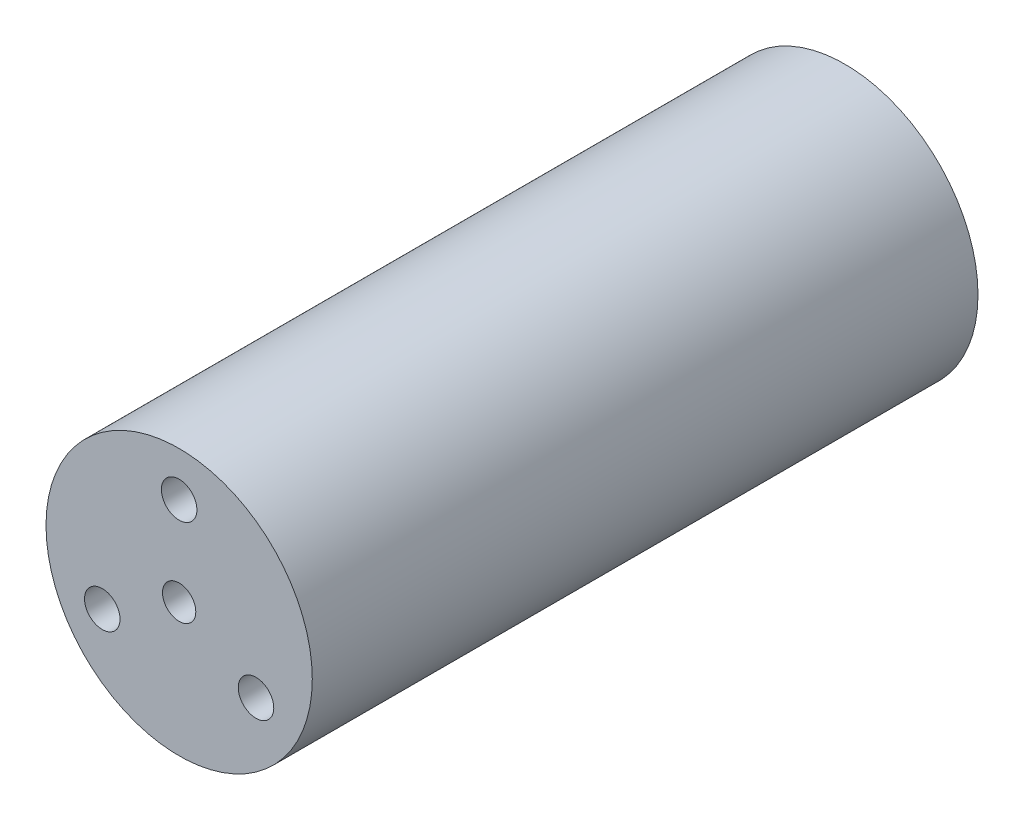
ISO-10303-21;
HEADER;
FILE_DESCRIPTION(('STEP AP214'),'2;1');
FILE_NAME('part.step','',(''),(''),'','','');
FILE_SCHEMA(('AUTOMOTIVE_DESIGN { 1 0 10303 214 1 1 1 1 }'));
ENDSEC;
DATA;
#1=APPLICATION_CONTEXT('core data for automotive mechanical design processes');
#2=APPLICATION_PROTOCOL_DEFINITION('international standard','automotive_design',2000,#1);
#3=PRODUCT_CONTEXT('',#1,'mechanical');
#4=PRODUCT('Part','Part','',(#3));
#5=PRODUCT_RELATED_PRODUCT_CATEGORY('part','',(#4));
#6=PRODUCT_DEFINITION_FORMATION('','',#4);
#7=PRODUCT_DEFINITION_CONTEXT('part definition',#1,'design');
#8=PRODUCT_DEFINITION('design','',#6,#7);
#9=PRODUCT_DEFINITION_SHAPE('','',#8);
#10=(LENGTH_UNIT() NAMED_UNIT(*) SI_UNIT(.MILLI.,.METRE.));
#11=(NAMED_UNIT(*) PLANE_ANGLE_UNIT() SI_UNIT($,.RADIAN.));
#12=(NAMED_UNIT(*) SI_UNIT($,.STERADIAN.) SOLID_ANGLE_UNIT());
#13=UNCERTAINTY_MEASURE_WITH_UNIT(LENGTH_MEASURE(1.E-05),#10,'distance_accuracy_value','');
#14=(GEOMETRIC_REPRESENTATION_CONTEXT(3) GLOBAL_UNCERTAINTY_ASSIGNED_CONTEXT((#13)) GLOBAL_UNIT_ASSIGNED_CONTEXT((#10,
#11,#12)) REPRESENTATION_CONTEXT('',''));
#15=CARTESIAN_POINT('',(0.,0.,0.));
#16=DIRECTION('',(0.,0.,1.));
#17=DIRECTION('',(1.,0.,0.));
#18=AXIS2_PLACEMENT_3D('',#15,#16,#17);
#19=CARTESIAN_POINT('',(0.,0.,30.));
#20=DIRECTION('',(0.,0.,1.));
#21=DIRECTION('',(1.,0.,0.));
#22=AXIS2_PLACEMENT_3D('',#19,#20,#21);
#23=PLANE('',#22);
#24=CARTESIAN_POINT('',(-3.46410161513777,-1.99999999999997,30.));
#25=DIRECTION('',(0.,0.,1.));
#26=DIRECTION('',(1.,0.,0.));
#27=AXIS2_PLACEMENT_3D('',#24,#25,#26);
#28=CIRCLE('',#27,0.799999999999998);
#29=CARTESIAN_POINT('',(-2.66410161513777,-1.99999999999997,30.));
#30=VERTEX_POINT('',#29);
#31=EDGE_CURVE('E61',#30,#30,#28,.T.);
#32=ORIENTED_EDGE('',*,*,#31,.F.);
#33=EDGE_LOOP('',(#32));
#34=FACE_BOUND('',#33,.T.);
#35=CARTESIAN_POINT('',(3.46410161513775,-2.00000000000002,30.));
#36=DIRECTION('',(0.,0.,1.));
#37=DIRECTION('',(1.,0.,0.));
#38=AXIS2_PLACEMENT_3D('',#35,#36,#37);
#39=CIRCLE('',#38,0.799999999999998);
#40=CARTESIAN_POINT('',(4.26410161513774,-2.00000000000002,30.));
#41=VERTEX_POINT('',#40);
#42=EDGE_CURVE('E60',#41,#41,#39,.T.);
#43=ORIENTED_EDGE('',*,*,#42,.F.);
#44=EDGE_LOOP('',(#43));
#45=FACE_BOUND('',#44,.T.);
#46=CARTESIAN_POINT('',(0.,4.,30.));
#47=DIRECTION('',(0.,0.,1.));
#48=DIRECTION('',(1.,0.,0.));
#49=AXIS2_PLACEMENT_3D('',#46,#47,#48);
#50=CIRCLE('',#49,0.799999999999998);
#51=CARTESIAN_POINT('',(0.799999999999998,4.,30.));
#52=VERTEX_POINT('',#51);
#53=EDGE_CURVE('E73',#52,#52,#50,.T.);
#54=ORIENTED_EDGE('',*,*,#53,.F.);
#55=EDGE_LOOP('',(#54));
#56=FACE_BOUND('',#55,.T.);
#57=CARTESIAN_POINT('',(0.,0.,30.));
#58=DIRECTION('',(0.,0.,1.));
#59=DIRECTION('',(1.,0.,0.));
#60=AXIS2_PLACEMENT_3D('',#57,#58,#59);
#61=CIRCLE('',#60,6.);
#62=CARTESIAN_POINT('',(6.,0.,30.));
#63=VERTEX_POINT('',#62);
#64=EDGE_CURVE('E11',#63,#63,#61,.T.);
#65=ORIENTED_EDGE('',*,*,#64,.T.);
#66=EDGE_LOOP('',(#65));
#67=FACE_BOUND('',#66,.T.);
#68=CARTESIAN_POINT('',(0.,0.,30.));
#69=DIRECTION('',(0.,0.,1.));
#70=DIRECTION('',(1.,0.,0.));
#71=AXIS2_PLACEMENT_3D('',#68,#69,#70);
#72=CIRCLE('',#71,0.75);
#73=CARTESIAN_POINT('',(0.75,0.,30.));
#74=VERTEX_POINT('',#73);
#75=EDGE_CURVE('E80',#74,#74,#72,.T.);
#76=ORIENTED_EDGE('',*,*,#75,.F.);
#77=EDGE_LOOP('',(#76));
#78=FACE_BOUND('',#77,.T.);
#79=ADVANCED_FACE('F32',(#34,#45,#56,#67,#78),#23,.T.);
#80=CARTESIAN_POINT('',(0.,0.,0.));
#81=DIRECTION('',(0.,0.,1.));
#82=DIRECTION('',(1.,0.,0.));
#83=AXIS2_PLACEMENT_3D('',#80,#81,#82);
#84=PLANE('',#83);
#85=CARTESIAN_POINT('',(-1.27553556471539,3.79117515068167,0.));
#86=DIRECTION('',(0.,0.,-1.));
#87=DIRECTION('',(1.,0.,0.));
#88=AXIS2_PLACEMENT_3D('',#85,#86,#87);
#89=CIRCLE('',#88,1.);
#90=CARTESIAN_POINT('',(-0.275535564715393,3.79117515068166,0.));
#91=VERTEX_POINT('',#90);
#92=EDGE_CURVE('E157',#91,#91,#89,.T.);
#93=ORIENTED_EDGE('',*,*,#92,.F.);
#94=EDGE_LOOP('',(#93));
#95=FACE_BOUND('',#94,.T.);
#96=CARTESIAN_POINT('',(1.27553556471542,-3.79117515068166,0.));
#97=DIRECTION('',(0.,0.,-1.));
#98=DIRECTION('',(-1.,0.,0.));
#99=AXIS2_PLACEMENT_3D('',#96,#97,#98);
#100=CIRCLE('',#99,1.);
#101=CARTESIAN_POINT('',(0.275535564715419,-3.79117515068166,0.));
#102=VERTEX_POINT('',#101);
#103=EDGE_CURVE('E156',#102,#102,#100,.T.);
#104=ORIENTED_EDGE('',*,*,#103,.F.);
#105=EDGE_LOOP('',(#104));
#106=FACE_BOUND('',#105,.T.);
#107=CARTESIAN_POINT('',(0.,0.,0.));
#108=DIRECTION('',(0.,0.,1.));
#109=DIRECTION('',(1.,0.,0.));
#110=AXIS2_PLACEMENT_3D('',#107,#108,#109);
#111=CIRCLE('',#110,6.);
#112=CARTESIAN_POINT('',(6.,0.,0.));
#113=VERTEX_POINT('',#112);
#114=EDGE_CURVE('E36',#113,#113,#111,.T.);
#115=ORIENTED_EDGE('',*,*,#114,.F.);
#116=EDGE_LOOP('',(#115));
#117=FACE_BOUND('',#116,.T.);
#118=CARTESIAN_POINT('',(0.,0.,0.));
#119=DIRECTION('',(0.,0.,1.));
#120=DIRECTION('',(1.,0.,0.));
#121=AXIS2_PLACEMENT_3D('',#118,#119,#120);
#122=CIRCLE('',#121,0.75);
#123=CARTESIAN_POINT('',(0.75,0.,0.));
#124=VERTEX_POINT('',#123);
#125=EDGE_CURVE('E79',#124,#124,#122,.T.);
#126=ORIENTED_EDGE('',*,*,#125,.T.);
#127=EDGE_LOOP('',(#126));
#128=FACE_BOUND('',#127,.T.);
#129=ADVANCED_FACE('F86',(#95,#106,#117,#128),#84,.F.);
#130=CARTESIAN_POINT('',(0.,0.,30.));
#131=DIRECTION('',(0.,0.,-1.));
#132=DIRECTION('',(-1.,0.,0.));
#133=AXIS2_PLACEMENT_3D('',#130,#131,#132);
#134=CYLINDRICAL_SURFACE('',#133,6.);
#135=ORIENTED_EDGE('',*,*,#64,.F.);
#136=EDGE_LOOP('',(#135));
#137=FACE_BOUND('',#136,.T.);
#138=ORIENTED_EDGE('',*,*,#114,.T.);
#139=EDGE_LOOP('',(#138));
#140=FACE_BOUND('',#139,.T.);
#141=ADVANCED_FACE('F34',(#137,#140),#134,.T.);
#142=CARTESIAN_POINT('',(0.,0.,30.));
#143=DIRECTION('',(0.,0.,-1.));
#144=DIRECTION('',(-1.,0.,0.));
#145=AXIS2_PLACEMENT_3D('',#142,#143,#144);
#146=CYLINDRICAL_SURFACE('',#145,0.75);
#147=ORIENTED_EDGE('',*,*,#75,.T.);
#148=EDGE_LOOP('',(#147));
#149=FACE_BOUND('',#148,.T.);
#150=ORIENTED_EDGE('',*,*,#125,.F.);
#151=EDGE_LOOP('',(#150));
#152=FACE_BOUND('',#151,.T.);
#153=ADVANCED_FACE('F88',(#149,#152),#146,.F.);
#154=CARTESIAN_POINT('',(0.,4.,24.));
#155=DIRECTION('',(0.,0.,1.));
#156=DIRECTION('',(1.,0.,0.));
#157=AXIS2_PLACEMENT_3D('',#154,#155,#156);
#158=CONICAL_SURFACE('',#157,0.799999999999997,1.02974425867665);
#159=CARTESIAN_POINT('',(0.,4.,23.5193115047779));
#160=VERTEX_POINT('',#159);
#161=VERTEX_LOOP('',#160);
#162=FACE_BOUND('',#161,.T.);
#163=CARTESIAN_POINT('',(0.,4.,24.));
#164=DIRECTION('',(0.,0.,1.));
#165=DIRECTION('',(1.,0.,0.));
#166=AXIS2_PLACEMENT_3D('',#163,#164,#165);
#167=CIRCLE('',#166,0.799999999999997);
#168=CARTESIAN_POINT('',(0.799999999999997,4.,24.));
#169=VERTEX_POINT('',#168);
#170=EDGE_CURVE('E76',#169,#169,#167,.T.);
#171=ORIENTED_EDGE('',*,*,#170,.T.);
#172=EDGE_LOOP('',(#171));
#173=FACE_BOUND('',#172,.T.);
#174=ADVANCED_FACE('F90',(#162,#173),#158,.F.);
#175=CARTESIAN_POINT('',(0.,4.,30.));
#176=DIRECTION('',(0.,0.,1.));
#177=DIRECTION('',(1.,0.,0.));
#178=AXIS2_PLACEMENT_3D('',#175,#176,#177);
#179=CYLINDRICAL_SURFACE('',#178,0.799999999999998);
#180=ORIENTED_EDGE('',*,*,#170,.F.);
#181=EDGE_LOOP('',(#180));
#182=FACE_BOUND('',#181,.T.);
#183=ORIENTED_EDGE('',*,*,#53,.T.);
#184=EDGE_LOOP('',(#183));
#185=FACE_BOUND('',#184,.T.);
#186=ADVANCED_FACE('F97',(#182,#185),#179,.F.);
#187=CARTESIAN_POINT('',(3.46410161513775,-2.00000000000002,24.));
#188=DIRECTION('',(0.,0.,1.));
#189=DIRECTION('',(1.,0.,0.));
#190=AXIS2_PLACEMENT_3D('',#187,#188,#189);
#191=CONICAL_SURFACE('',#190,0.799999999999997,1.02974425867665);
#192=CARTESIAN_POINT('',(3.46410161513774,-2.00000000000002,23.5193115047779));
#193=VERTEX_POINT('',#192);
#194=VERTEX_LOOP('',#193);
#195=FACE_BOUND('',#194,.T.);
#196=CARTESIAN_POINT('',(3.46410161513775,-2.00000000000002,24.));
#197=DIRECTION('',(0.,0.,1.));
#198=DIRECTION('',(1.,0.,0.));
#199=AXIS2_PLACEMENT_3D('',#196,#197,#198);
#200=CIRCLE('',#199,0.799999999999997);
#201=CARTESIAN_POINT('',(4.26410161513774,-2.00000000000002,24.));
#202=VERTEX_POINT('',#201);
#203=EDGE_CURVE('E64',#202,#202,#200,.T.);
#204=ORIENTED_EDGE('',*,*,#203,.T.);
#205=EDGE_LOOP('',(#204));
#206=FACE_BOUND('',#205,.T.);
#207=ADVANCED_FACE('F122',(#195,#206),#191,.F.);
#208=CARTESIAN_POINT('',(3.46410161513775,-2.00000000000002,30.));
#209=DIRECTION('',(0.,0.,1.));
#210=DIRECTION('',(1.,0.,0.));
#211=AXIS2_PLACEMENT_3D('',#208,#209,#210);
#212=CYLINDRICAL_SURFACE('',#211,0.799999999999997);
#213=ORIENTED_EDGE('',*,*,#203,.F.);
#214=EDGE_LOOP('',(#213));
#215=FACE_BOUND('',#214,.T.);
#216=ORIENTED_EDGE('',*,*,#42,.T.);
#217=EDGE_LOOP('',(#216));
#218=FACE_BOUND('',#217,.T.);
#219=ADVANCED_FACE('F54',(#215,#218),#212,.F.);
#220=CARTESIAN_POINT('',(-3.46410161513777,-1.99999999999997,24.));
#221=DIRECTION('',(0.,0.,1.));
#222=DIRECTION('',(1.,0.,0.));
#223=AXIS2_PLACEMENT_3D('',#220,#221,#222);
#224=CONICAL_SURFACE('',#223,0.799999999999997,1.02974425867665);
#225=CARTESIAN_POINT('',(-3.46410161513777,-1.99999999999997,23.5193115047779));
#226=VERTEX_POINT('',#225);
#227=VERTEX_LOOP('',#226);
#228=FACE_BOUND('',#227,.T.);
#229=CARTESIAN_POINT('',(-3.46410161513777,-1.99999999999997,24.));
#230=DIRECTION('',(0.,0.,1.));
#231=DIRECTION('',(1.,0.,0.));
#232=AXIS2_PLACEMENT_3D('',#229,#230,#231);
#233=CIRCLE('',#232,0.799999999999997);
#234=CARTESIAN_POINT('',(-2.66410161513778,-1.99999999999997,24.));
#235=VERTEX_POINT('',#234);
#236=EDGE_CURVE('E58',#235,#235,#233,.T.);
#237=ORIENTED_EDGE('',*,*,#236,.T.);
#238=EDGE_LOOP('',(#237));
#239=FACE_BOUND('',#238,.T.);
#240=ADVANCED_FACE('F50',(#228,#239),#224,.F.);
#241=CARTESIAN_POINT('',(-3.46410161513777,-1.99999999999997,30.));
#242=DIRECTION('',(0.,0.,1.));
#243=DIRECTION('',(1.,0.,0.));
#244=AXIS2_PLACEMENT_3D('',#241,#242,#243);
#245=CYLINDRICAL_SURFACE('',#244,0.799999999999997);
#246=ORIENTED_EDGE('',*,*,#236,.F.);
#247=EDGE_LOOP('',(#246));
#248=FACE_BOUND('',#247,.T.);
#249=ORIENTED_EDGE('',*,*,#31,.T.);
#250=EDGE_LOOP('',(#249));
#251=FACE_BOUND('',#250,.T.);
#252=ADVANCED_FACE('F53',(#248,#251),#245,.F.);
#253=CARTESIAN_POINT('',(1.27553556471542,-3.79117515068166,2.));
#254=DIRECTION('',(0.,0.,-1.));
#255=DIRECTION('',(-1.,0.,0.));
#256=AXIS2_PLACEMENT_3D('',#253,#254,#255);
#257=CYLINDRICAL_SURFACE('',#256,1.);
#258=CARTESIAN_POINT('',(1.27553556471542,-3.79117515068166,2.));
#259=DIRECTION('',(0.,0.,-1.));
#260=DIRECTION('',(-1.,0.,0.));
#261=AXIS2_PLACEMENT_3D('',#258,#259,#260);
#262=CIRCLE('',#261,1.);
#263=CARTESIAN_POINT('',(0.275535564715419,-3.79117515068166,2.));
#264=VERTEX_POINT('',#263);
#265=EDGE_CURVE('E67',#264,#264,#262,.T.);
#266=ORIENTED_EDGE('',*,*,#265,.F.);
#267=EDGE_LOOP('',(#266));
#268=FACE_BOUND('',#267,.T.);
#269=ORIENTED_EDGE('',*,*,#103,.T.);
#270=EDGE_LOOP('',(#269));
#271=FACE_BOUND('',#270,.T.);
#272=ADVANCED_FACE('F136',(#268,#271),#257,.F.);
#273=CARTESIAN_POINT('',(1.27553556471542,-3.79117515068166,2.));
#274=DIRECTION('',(0.,0.,-1.));
#275=DIRECTION('',(-1.,0.,0.));
#276=AXIS2_PLACEMENT_3D('',#273,#274,#275);
#277=PLANE('',#276);
#278=ORIENTED_EDGE('',*,*,#265,.T.);
#279=EDGE_LOOP('',(#278));
#280=FACE_BOUND('',#279,.T.);
#281=ADVANCED_FACE('F139',(#280),#277,.T.);
#282=CARTESIAN_POINT('',(-1.27553556471539,3.79117515068167,2.));
#283=DIRECTION('',(0.,0.,-1.));
#284=DIRECTION('',(-1.,0.,0.));
#285=AXIS2_PLACEMENT_3D('',#282,#283,#284);
#286=CYLINDRICAL_SURFACE('',#285,1.);
#287=CARTESIAN_POINT('',(-1.27553556471539,3.79117515068167,2.));
#288=DIRECTION('',(0.,0.,-1.));
#289=DIRECTION('',(1.,0.,0.));
#290=AXIS2_PLACEMENT_3D('',#287,#288,#289);
#291=CIRCLE('',#290,1.);
#292=CARTESIAN_POINT('',(-0.275535564715393,3.79117515068166,2.));
#293=VERTEX_POINT('',#292);
#294=EDGE_CURVE('E155',#293,#293,#291,.T.);
#295=ORIENTED_EDGE('',*,*,#294,.F.);
#296=EDGE_LOOP('',(#295));
#297=FACE_BOUND('',#296,.T.);
#298=ORIENTED_EDGE('',*,*,#92,.T.);
#299=EDGE_LOOP('',(#298));
#300=FACE_BOUND('',#299,.T.);
#301=ADVANCED_FACE('F143',(#297,#300),#286,.F.);
#302=CARTESIAN_POINT('',(-1.27553556471539,3.79117515068167,2.));
#303=DIRECTION('',(0.,0.,-1.));
#304=DIRECTION('',(1.,0.,0.));
#305=AXIS2_PLACEMENT_3D('',#302,#303,#304);
#306=PLANE('',#305);
#307=ORIENTED_EDGE('',*,*,#294,.T.);
#308=EDGE_LOOP('',(#307));
#309=FACE_BOUND('',#308,.T.);
#310=ADVANCED_FACE('F147',(#309),#306,.T.);
#311=CLOSED_SHELL('',(#79,#129,#141,#153,#174,#186,#207,#219,#240,#252,#272,#281,#301,#310));
#312=MANIFOLD_SOLID_BREP('B2',#311);
#313=ADVANCED_BREP_SHAPE_REPRESENTATION('',(#18,#312),#14);
#314=SHAPE_DEFINITION_REPRESENTATION(#9,#313);
ENDSEC;
END-ISO-10303-21;
